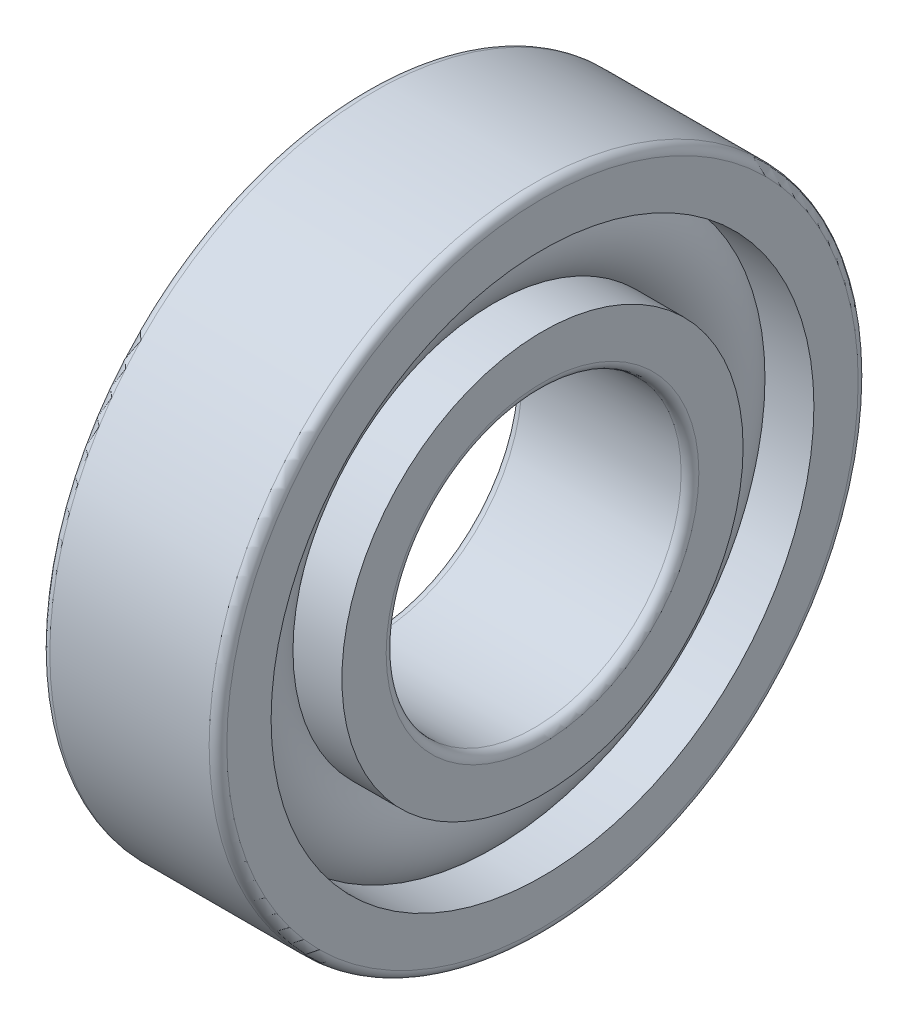
ISO-10303-21;
HEADER;
FILE_DESCRIPTION(('STEP AP214'),'2;1');
FILE_NAME('part.step','',(''),(''),'','','');
FILE_SCHEMA(('AUTOMOTIVE_DESIGN { 1 0 10303 214 1 1 1 1 }'));
ENDSEC;
DATA;
#1=APPLICATION_CONTEXT('core data for automotive mechanical design processes');
#2=APPLICATION_PROTOCOL_DEFINITION('international standard','automotive_design',2000,#1);
#3=PRODUCT_CONTEXT('',#1,'mechanical');
#4=PRODUCT('Part','Part','',(#3));
#5=PRODUCT_RELATED_PRODUCT_CATEGORY('part','',(#4));
#6=PRODUCT_DEFINITION_FORMATION('','',#4);
#7=PRODUCT_DEFINITION_CONTEXT('part definition',#1,'design');
#8=PRODUCT_DEFINITION('design','',#6,#7);
#9=PRODUCT_DEFINITION_SHAPE('','',#8);
#10=(LENGTH_UNIT() NAMED_UNIT(*) SI_UNIT(.MILLI.,.METRE.));
#11=(NAMED_UNIT(*) PLANE_ANGLE_UNIT() SI_UNIT($,.RADIAN.));
#12=(NAMED_UNIT(*) SI_UNIT($,.STERADIAN.) SOLID_ANGLE_UNIT());
#13=UNCERTAINTY_MEASURE_WITH_UNIT(LENGTH_MEASURE(1.E-05),#10,'distance_accuracy_value','');
#14=(GEOMETRIC_REPRESENTATION_CONTEXT(3) GLOBAL_UNCERTAINTY_ASSIGNED_CONTEXT((#13)) GLOBAL_UNIT_ASSIGNED_CONTEXT((#10,
#11,#12)) REPRESENTATION_CONTEXT('',''));
#15=CARTESIAN_POINT('',(0.,0.,0.));
#16=DIRECTION('',(0.,0.,1.));
#17=DIRECTION('',(1.,0.,0.));
#18=AXIS2_PLACEMENT_3D('',#15,#16,#17);
#19=CARTESIAN_POINT('',(0.,0.,0.));
#20=DIRECTION('',(-1.,0.,0.));
#21=DIRECTION('',(0.,0.,1.));
#22=AXIS2_PLACEMENT_3D('',#19,#20,#21);
#23=TOROIDAL_SURFACE('',#22,4.,0.9);
#24=CARTESIAN_POINT('',(0.670820393249932,0.,0.));
#25=DIRECTION('',(-1.,0.,0.));
#26=DIRECTION('',(0.,0.,1.));
#27=AXIS2_PLACEMENT_3D('',#24,#25,#26);
#28=CIRCLE('',#27,4.6);
#29=CARTESIAN_POINT('',(0.670820393249932,0.,4.6));
#30=VERTEX_POINT('',#29);
#31=EDGE_CURVE('E34',#30,#30,#28,.F.);
#32=ORIENTED_EDGE('',*,*,#31,.T.);
#33=EDGE_LOOP('',(#32));
#34=FACE_BOUND('',#33,.T.);
#35=CARTESIAN_POINT('',(0.670820393249936,0.,0.));
#36=DIRECTION('',(-1.,0.,0.));
#37=DIRECTION('',(0.,0.,1.));
#38=AXIS2_PLACEMENT_3D('',#35,#36,#37);
#39=CIRCLE('',#38,3.4);
#40=CARTESIAN_POINT('',(0.670820393249936,0.,3.4));
#41=VERTEX_POINT('',#40);
#42=EDGE_CURVE('E10',#41,#41,#39,.T.);
#43=ORIENTED_EDGE('',*,*,#42,.T.);
#44=EDGE_LOOP('',(#43));
#45=FACE_BOUND('',#44,.T.);
#46=ADVANCED_FACE('F30',(#34,#45),#23,.T.);
#47=CARTESIAN_POINT('',(-20.6375,0.,0.));
#48=DIRECTION('',(1.,0.,0.));
#49=DIRECTION('',(0.,0.,-1.));
#50=AXIS2_PLACEMENT_3D('',#47,#48,#49);
#51=CYLINDRICAL_SURFACE('',#50,3.4);
#52=CARTESIAN_POINT('',(1.5,0.,0.));
#53=DIRECTION('',(1.,0.,0.));
#54=DIRECTION('',(0.,0.,-1.));
#55=AXIS2_PLACEMENT_3D('',#52,#53,#54);
#56=CIRCLE('',#55,3.4);
#57=CARTESIAN_POINT('',(1.5,0.,-3.4));
#58=VERTEX_POINT('',#57);
#59=EDGE_CURVE('E43',#58,#58,#56,.T.);
#60=ORIENTED_EDGE('',*,*,#59,.F.);
#61=EDGE_LOOP('',(#60));
#62=FACE_BOUND('',#61,.T.);
#63=ORIENTED_EDGE('',*,*,#42,.F.);
#64=EDGE_LOOP('',(#63));
#65=FACE_BOUND('',#64,.T.);
#66=ADVANCED_FACE('F82',(#62,#65),#51,.T.);
#67=CARTESIAN_POINT('',(-20.6375,0.,0.));
#68=DIRECTION('',(1.,0.,0.));
#69=DIRECTION('',(0.,0.,-1.));
#70=AXIS2_PLACEMENT_3D('',#67,#68,#69);
#71=CYLINDRICAL_SURFACE('',#70,3.4);
#72=CARTESIAN_POINT('',(-1.5,0.,0.));
#73=DIRECTION('',(1.,0.,0.));
#74=DIRECTION('',(0.,0.,-1.));
#75=AXIS2_PLACEMENT_3D('',#72,#73,#74);
#76=CIRCLE('',#75,3.4);
#77=CARTESIAN_POINT('',(-1.5,0.,-3.4));
#78=VERTEX_POINT('',#77);
#79=EDGE_CURVE('E52',#78,#78,#76,.T.);
#80=ORIENTED_EDGE('',*,*,#79,.T.);
#81=EDGE_LOOP('',(#80));
#82=FACE_BOUND('',#81,.T.);
#83=CARTESIAN_POINT('',(-0.670820393249936,0.,0.));
#84=DIRECTION('',(1.,0.,0.));
#85=DIRECTION('',(0.,0.,-1.));
#86=AXIS2_PLACEMENT_3D('',#83,#84,#85);
#87=CIRCLE('',#86,3.4);
#88=CARTESIAN_POINT('',(-0.670820393249936,0.,-3.4));
#89=VERTEX_POINT('',#88);
#90=EDGE_CURVE('E38',#89,#89,#87,.T.);
#91=ORIENTED_EDGE('',*,*,#90,.F.);
#92=EDGE_LOOP('',(#91));
#93=FACE_BOUND('',#92,.T.);
#94=ADVANCED_FACE('F85',(#82,#93),#71,.T.);
#95=CARTESIAN_POINT('',(1.5,2.65,0.));
#96=DIRECTION('',(1.,0.,0.));
#97=DIRECTION('',(0.,0.,-1.));
#98=AXIS2_PLACEMENT_3D('',#95,#96,#97);
#99=PLANE('',#98);
#100=ORIENTED_EDGE('',*,*,#59,.T.);
#101=EDGE_LOOP('',(#100));
#102=FACE_BOUND('',#101,.T.);
#103=CARTESIAN_POINT('',(1.5,0.,0.));
#104=DIRECTION('',(1.,0.,0.));
#105=DIRECTION('',(0.,0.,-1.));
#106=AXIS2_PLACEMENT_3D('',#103,#104,#105);
#107=CIRCLE('',#106,2.65);
#108=CARTESIAN_POINT('',(1.5,0.,-2.65));
#109=VERTEX_POINT('',#108);
#110=EDGE_CURVE('E74',#109,#109,#107,.T.);
#111=ORIENTED_EDGE('',*,*,#110,.F.);
#112=EDGE_LOOP('',(#111));
#113=FACE_BOUND('',#112,.T.);
#114=ADVANCED_FACE('F79',(#102,#113),#99,.T.);
#115=CARTESIAN_POINT('',(1.35,0.,0.));
#116=DIRECTION('',(1.,0.,0.));
#117=DIRECTION('',(0.,0.,-1.));
#118=AXIS2_PLACEMENT_3D('',#115,#116,#117);
#119=TOROIDAL_SURFACE('',#118,2.65,0.149999999999999);
#120=ORIENTED_EDGE('',*,*,#110,.T.);
#121=EDGE_LOOP('',(#120));
#122=FACE_BOUND('',#121,.T.);
#123=CARTESIAN_POINT('',(1.35,0.,0.));
#124=DIRECTION('',(1.,0.,0.));
#125=DIRECTION('',(0.,0.,-1.));
#126=AXIS2_PLACEMENT_3D('',#123,#124,#125);
#127=CIRCLE('',#126,2.5);
#128=CARTESIAN_POINT('',(1.35,0.,-2.5));
#129=VERTEX_POINT('',#128);
#130=EDGE_CURVE('E71',#129,#129,#127,.T.);
#131=ORIENTED_EDGE('',*,*,#130,.F.);
#132=EDGE_LOOP('',(#131));
#133=FACE_BOUND('',#132,.T.);
#134=ADVANCED_FACE('F96',(#122,#133),#119,.T.);
#135=CARTESIAN_POINT('',(-20.6375,0.,0.));
#136=DIRECTION('',(1.,0.,0.));
#137=DIRECTION('',(0.,0.,-1.));
#138=AXIS2_PLACEMENT_3D('',#135,#136,#137);
#139=CYLINDRICAL_SURFACE('',#138,2.5);
#140=ORIENTED_EDGE('',*,*,#130,.T.);
#141=EDGE_LOOP('',(#140));
#142=FACE_BOUND('',#141,.T.);
#143=CARTESIAN_POINT('',(-1.35,0.,0.));
#144=DIRECTION('',(1.,0.,0.));
#145=DIRECTION('',(0.,0.,-1.));
#146=AXIS2_PLACEMENT_3D('',#143,#144,#145);
#147=CIRCLE('',#146,2.5);
#148=CARTESIAN_POINT('',(-1.35,0.,-2.5));
#149=VERTEX_POINT('',#148);
#150=EDGE_CURVE('E68',#149,#149,#147,.T.);
#151=ORIENTED_EDGE('',*,*,#150,.F.);
#152=EDGE_LOOP('',(#151));
#153=FACE_BOUND('',#152,.T.);
#154=ADVANCED_FACE('F99',(#142,#153),#139,.F.);
#155=CARTESIAN_POINT('',(-1.35,0.,0.));
#156=DIRECTION('',(1.,0.,0.));
#157=DIRECTION('',(0.,0.,-1.));
#158=AXIS2_PLACEMENT_3D('',#155,#156,#157);
#159=TOROIDAL_SURFACE('',#158,2.65,0.149999999999999);
#160=ORIENTED_EDGE('',*,*,#150,.T.);
#161=EDGE_LOOP('',(#160));
#162=FACE_BOUND('',#161,.T.);
#163=CARTESIAN_POINT('',(-1.5,0.,0.));
#164=DIRECTION('',(1.,0.,0.));
#165=DIRECTION('',(0.,0.,-1.));
#166=AXIS2_PLACEMENT_3D('',#163,#164,#165);
#167=CIRCLE('',#166,2.65);
#168=CARTESIAN_POINT('',(-1.5,0.,-2.65));
#169=VERTEX_POINT('',#168);
#170=EDGE_CURVE('E65',#169,#169,#167,.T.);
#171=ORIENTED_EDGE('',*,*,#170,.F.);
#172=EDGE_LOOP('',(#171));
#173=FACE_BOUND('',#172,.T.);
#174=ADVANCED_FACE('F103',(#162,#173),#159,.T.);
#175=CARTESIAN_POINT('',(-1.5,3.4,0.));
#176=DIRECTION('',(-1.,0.,0.));
#177=DIRECTION('',(0.,0.,1.));
#178=AXIS2_PLACEMENT_3D('',#175,#176,#177);
#179=PLANE('',#178);
#180=ORIENTED_EDGE('',*,*,#170,.T.);
#181=EDGE_LOOP('',(#180));
#182=FACE_BOUND('',#181,.T.);
#183=ORIENTED_EDGE('',*,*,#79,.F.);
#184=EDGE_LOOP('',(#183));
#185=FACE_BOUND('',#184,.T.);
#186=ADVANCED_FACE('F107',(#182,#185),#179,.T.);
#187=CARTESIAN_POINT('',(-0.670820393249932,0.,0.));
#188=DIRECTION('',(1.,0.,0.));
#189=DIRECTION('',(0.,0.,-1.));
#190=AXIS2_PLACEMENT_3D('',#187,#188,#189);
#191=CIRCLE('',#190,4.6);
#192=CARTESIAN_POINT('',(-0.670820393249932,0.,-4.6));
#193=VERTEX_POINT('',#192);
#194=EDGE_CURVE('E46',#193,#193,#191,.F.);
#195=ORIENTED_EDGE('',*,*,#194,.T.);
#196=EDGE_LOOP('',(#195));
#197=FACE_BOUND('',#196,.T.);
#198=ORIENTED_EDGE('',*,*,#90,.T.);
#199=EDGE_LOOP('',(#198));
#200=FACE_BOUND('',#199,.T.);
#201=ADVANCED_FACE('F32',(#197,#200),#23,.T.);
#202=CARTESIAN_POINT('',(-20.6375,0.,0.));
#203=DIRECTION('',(1.,0.,0.));
#204=DIRECTION('',(0.,0.,-1.));
#205=AXIS2_PLACEMENT_3D('',#202,#203,#204);
#206=CYLINDRICAL_SURFACE('',#205,4.6);
#207=CARTESIAN_POINT('',(1.5,0.,0.));
#208=DIRECTION('',(1.,0.,0.));
#209=DIRECTION('',(0.,0.,-1.));
#210=AXIS2_PLACEMENT_3D('',#207,#208,#209);
#211=CIRCLE('',#210,4.6);
#212=CARTESIAN_POINT('',(1.5,0.,-4.6));
#213=VERTEX_POINT('',#212);
#214=EDGE_CURVE('E48',#213,#213,#211,.T.);
#215=ORIENTED_EDGE('',*,*,#214,.T.);
#216=EDGE_LOOP('',(#215));
#217=FACE_BOUND('',#216,.T.);
#218=ORIENTED_EDGE('',*,*,#31,.F.);
#219=EDGE_LOOP('',(#218));
#220=FACE_BOUND('',#219,.T.);
#221=ADVANCED_FACE('F112',(#217,#220),#206,.F.);
#222=CARTESIAN_POINT('',(-20.6375,0.,0.));
#223=DIRECTION('',(1.,0.,0.));
#224=DIRECTION('',(0.,0.,-1.));
#225=AXIS2_PLACEMENT_3D('',#222,#223,#224);
#226=CYLINDRICAL_SURFACE('',#225,4.6);
#227=CARTESIAN_POINT('',(-1.5,0.,0.));
#228=DIRECTION('',(1.,0.,0.));
#229=DIRECTION('',(0.,0.,-1.));
#230=AXIS2_PLACEMENT_3D('',#227,#228,#229);
#231=CIRCLE('',#230,4.6);
#232=CARTESIAN_POINT('',(-1.5,0.,-4.6));
#233=VERTEX_POINT('',#232);
#234=EDGE_CURVE('E143',#233,#233,#231,.T.);
#235=ORIENTED_EDGE('',*,*,#234,.F.);
#236=EDGE_LOOP('',(#235));
#237=FACE_BOUND('',#236,.T.);
#238=ORIENTED_EDGE('',*,*,#194,.F.);
#239=EDGE_LOOP('',(#238));
#240=FACE_BOUND('',#239,.T.);
#241=ADVANCED_FACE('F115',(#237,#240),#226,.F.);
#242=CARTESIAN_POINT('',(1.5,5.35,0.));
#243=DIRECTION('',(1.,0.,0.));
#244=DIRECTION('',(0.,0.,-1.));
#245=AXIS2_PLACEMENT_3D('',#242,#243,#244);
#246=PLANE('',#245);
#247=CARTESIAN_POINT('',(1.5,0.,0.));
#248=DIRECTION('',(1.,0.,0.));
#249=DIRECTION('',(0.,0.,-1.));
#250=AXIS2_PLACEMENT_3D('',#247,#248,#249);
#251=CIRCLE('',#250,5.35);
#252=CARTESIAN_POINT('',(1.5,0.,-5.35));
#253=VERTEX_POINT('',#252);
#254=EDGE_CURVE('E54',#253,#253,#251,.T.);
#255=ORIENTED_EDGE('',*,*,#254,.T.);
#256=EDGE_LOOP('',(#255));
#257=FACE_BOUND('',#256,.T.);
#258=ORIENTED_EDGE('',*,*,#214,.F.);
#259=EDGE_LOOP('',(#258));
#260=FACE_BOUND('',#259,.T.);
#261=ADVANCED_FACE('F116',(#257,#260),#246,.T.);
#262=CARTESIAN_POINT('',(1.35,0.,0.));
#263=DIRECTION('',(1.,0.,0.));
#264=DIRECTION('',(0.,0.,-1.));
#265=AXIS2_PLACEMENT_3D('',#262,#263,#264);
#266=TOROIDAL_SURFACE('',#265,5.35,0.149999999999999);
#267=CARTESIAN_POINT('',(1.35,0.,0.));
#268=DIRECTION('',(1.,0.,0.));
#269=DIRECTION('',(0.,0.,-1.));
#270=AXIS2_PLACEMENT_3D('',#267,#268,#269);
#271=CIRCLE('',#270,5.5);
#272=CARTESIAN_POINT('',(1.35,0.,-5.5));
#273=VERTEX_POINT('',#272);
#274=EDGE_CURVE('E59',#273,#273,#271,.T.);
#275=ORIENTED_EDGE('',*,*,#274,.T.);
#276=EDGE_LOOP('',(#275));
#277=FACE_BOUND('',#276,.T.);
#278=ORIENTED_EDGE('',*,*,#254,.F.);
#279=EDGE_LOOP('',(#278));
#280=FACE_BOUND('',#279,.T.);
#281=ADVANCED_FACE('F119',(#277,#280),#266,.T.);
#282=CARTESIAN_POINT('',(-20.6375,0.,0.));
#283=DIRECTION('',(1.,0.,0.));
#284=DIRECTION('',(0.,0.,-1.));
#285=AXIS2_PLACEMENT_3D('',#282,#283,#284);
#286=CYLINDRICAL_SURFACE('',#285,5.5);
#287=CARTESIAN_POINT('',(-1.35,0.,0.));
#288=DIRECTION('',(1.,0.,0.));
#289=DIRECTION('',(0.,0.,-1.));
#290=AXIS2_PLACEMENT_3D('',#287,#288,#289);
#291=CIRCLE('',#290,5.5);
#292=CARTESIAN_POINT('',(-1.35,0.,-5.5));
#293=VERTEX_POINT('',#292);
#294=EDGE_CURVE('E147',#293,#293,#291,.T.);
#295=ORIENTED_EDGE('',*,*,#294,.T.);
#296=EDGE_LOOP('',(#295));
#297=FACE_BOUND('',#296,.T.);
#298=ORIENTED_EDGE('',*,*,#274,.F.);
#299=EDGE_LOOP('',(#298));
#300=FACE_BOUND('',#299,.T.);
#301=ADVANCED_FACE('F123',(#297,#300),#286,.T.);
#302=CARTESIAN_POINT('',(-1.35,0.,0.));
#303=DIRECTION('',(1.,0.,0.));
#304=DIRECTION('',(0.,0.,-1.));
#305=AXIS2_PLACEMENT_3D('',#302,#303,#304);
#306=TOROIDAL_SURFACE('',#305,5.35,0.149999999999999);
#307=CARTESIAN_POINT('',(-1.5,0.,0.));
#308=DIRECTION('',(1.,0.,0.));
#309=DIRECTION('',(0.,0.,-1.));
#310=AXIS2_PLACEMENT_3D('',#307,#308,#309);
#311=CIRCLE('',#310,5.35);
#312=CARTESIAN_POINT('',(-1.5,0.,-5.35));
#313=VERTEX_POINT('',#312);
#314=EDGE_CURVE('E144',#313,#313,#311,.T.);
#315=ORIENTED_EDGE('',*,*,#314,.T.);
#316=EDGE_LOOP('',(#315));
#317=FACE_BOUND('',#316,.T.);
#318=ORIENTED_EDGE('',*,*,#294,.F.);
#319=EDGE_LOOP('',(#318));
#320=FACE_BOUND('',#319,.T.);
#321=ADVANCED_FACE('F127',(#317,#320),#306,.T.);
#322=CARTESIAN_POINT('',(-1.5,4.6,0.));
#323=DIRECTION('',(-1.,0.,0.));
#324=DIRECTION('',(0.,0.,1.));
#325=AXIS2_PLACEMENT_3D('',#322,#323,#324);
#326=PLANE('',#325);
#327=ORIENTED_EDGE('',*,*,#234,.T.);
#328=EDGE_LOOP('',(#327));
#329=FACE_BOUND('',#328,.T.);
#330=ORIENTED_EDGE('',*,*,#314,.F.);
#331=EDGE_LOOP('',(#330));
#332=FACE_BOUND('',#331,.T.);
#333=ADVANCED_FACE('F131',(#329,#332),#326,.T.);
#334=CLOSED_SHELL('',(#46,#66,#94,#114,#134,#154,#174,#186,#201,#221,#241,#261,#281,#301,#321,#333));
#335=MANIFOLD_SOLID_BREP('B2',#334);
#336=ADVANCED_BREP_SHAPE_REPRESENTATION('',(#18,#335),#14);
#337=SHAPE_DEFINITION_REPRESENTATION(#9,#336);
ENDSEC;
END-ISO-10303-21;
